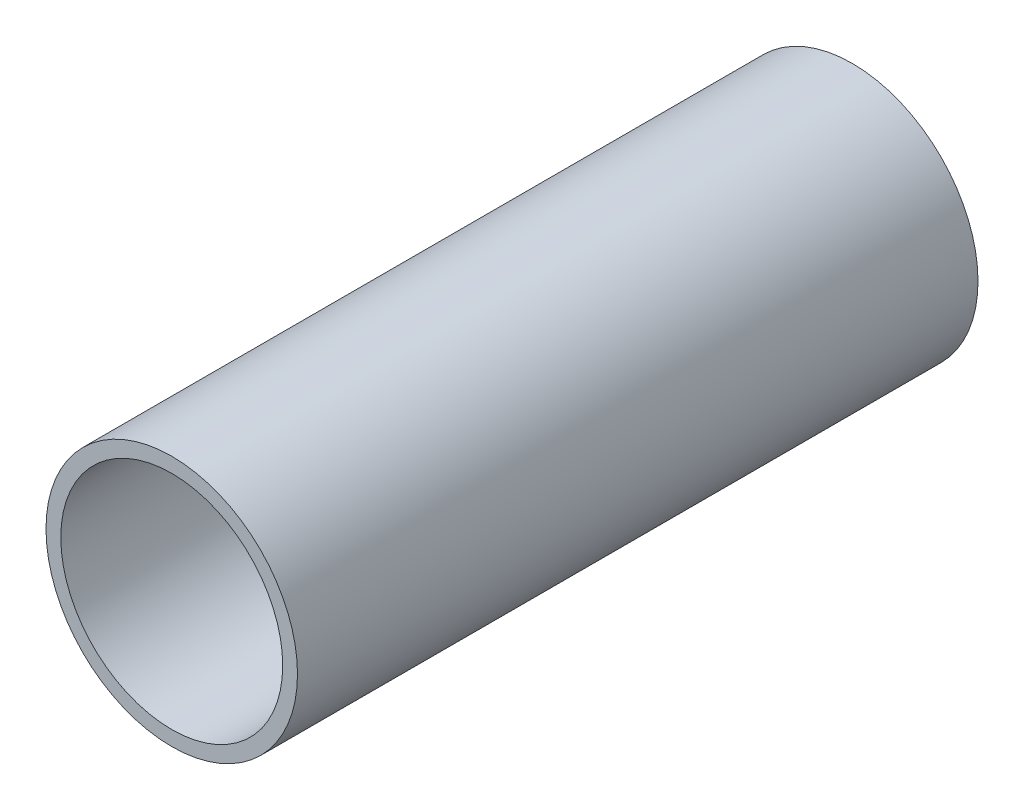
ISO-10303-21;
HEADER;
FILE_DESCRIPTION(('STEP AP214'),'2;1');
FILE_NAME('part.step','',(''),(''),'','','');
FILE_SCHEMA(('AUTOMOTIVE_DESIGN { 1 0 10303 214 1 1 1 1 }'));
ENDSEC;
DATA;
#1=APPLICATION_CONTEXT('core data for automotive mechanical design processes');
#2=APPLICATION_PROTOCOL_DEFINITION('international standard','automotive_design',2000,#1);
#3=PRODUCT_CONTEXT('',#1,'mechanical');
#4=PRODUCT('Part','Part','',(#3));
#5=PRODUCT_RELATED_PRODUCT_CATEGORY('part','',(#4));
#6=PRODUCT_DEFINITION_FORMATION('','',#4);
#7=PRODUCT_DEFINITION_CONTEXT('part definition',#1,'design');
#8=PRODUCT_DEFINITION('design','',#6,#7);
#9=PRODUCT_DEFINITION_SHAPE('','',#8);
#10=(LENGTH_UNIT() NAMED_UNIT(*) SI_UNIT(.MILLI.,.METRE.));
#11=(NAMED_UNIT(*) PLANE_ANGLE_UNIT() SI_UNIT($,.RADIAN.));
#12=(NAMED_UNIT(*) SI_UNIT($,.STERADIAN.) SOLID_ANGLE_UNIT());
#13=UNCERTAINTY_MEASURE_WITH_UNIT(LENGTH_MEASURE(1.E-05),#10,'distance_accuracy_value','');
#14=(GEOMETRIC_REPRESENTATION_CONTEXT(3) GLOBAL_UNCERTAINTY_ASSIGNED_CONTEXT((#13)) GLOBAL_UNIT_ASSIGNED_CONTEXT((#10,
#11,#12)) REPRESENTATION_CONTEXT('',''));
#15=CARTESIAN_POINT('',(0.,0.,0.));
#16=DIRECTION('',(0.,0.,1.));
#17=DIRECTION('',(1.,0.,0.));
#18=AXIS2_PLACEMENT_3D('',#15,#16,#17);
#19=CARTESIAN_POINT('',(0.,0.,460.));
#20=DIRECTION('',(0.,0.,1.));
#21=DIRECTION('',(1.,0.,0.));
#22=AXIS2_PLACEMENT_3D('',#19,#20,#21);
#23=PLANE('',#22);
#24=CARTESIAN_POINT('',(0.,0.,460.));
#25=DIRECTION('',(0.,0.,1.));
#26=DIRECTION('',(1.,0.,0.));
#27=AXIS2_PLACEMENT_3D('',#24,#25,#26);
#28=CIRCLE('',#27,85.);
#29=CARTESIAN_POINT('',(85.,0.,460.));
#30=VERTEX_POINT('',#29);
#31=EDGE_CURVE('E10',#30,#30,#28,.T.);
#32=ORIENTED_EDGE('',*,*,#31,.T.);
#33=EDGE_LOOP('',(#32));
#34=FACE_BOUND('',#33,.T.);
#35=CARTESIAN_POINT('',(0.,0.,460.));
#36=DIRECTION('',(0.,0.,1.));
#37=DIRECTION('',(1.,0.,0.));
#38=AXIS2_PLACEMENT_3D('',#35,#36,#37);
#39=CIRCLE('',#38,75.);
#40=CARTESIAN_POINT('',(75.,0.,460.));
#41=VERTEX_POINT('',#40);
#42=EDGE_CURVE('E54',#41,#41,#39,.T.);
#43=ORIENTED_EDGE('',*,*,#42,.F.);
#44=EDGE_LOOP('',(#43));
#45=FACE_BOUND('',#44,.T.);
#46=ADVANCED_FACE('F41',(#34,#45),#23,.T.);
#47=CARTESIAN_POINT('',(0.,0.,0.));
#48=DIRECTION('',(0.,0.,1.));
#49=DIRECTION('',(1.,0.,0.));
#50=AXIS2_PLACEMENT_3D('',#47,#48,#49);
#51=PLANE('',#50);
#52=CARTESIAN_POINT('',(0.,0.,0.));
#53=DIRECTION('',(0.,0.,1.));
#54=DIRECTION('',(1.,0.,0.));
#55=AXIS2_PLACEMENT_3D('',#52,#53,#54);
#56=CIRCLE('',#55,85.);
#57=CARTESIAN_POINT('',(85.,0.,0.));
#58=VERTEX_POINT('',#57);
#59=EDGE_CURVE('E45',#58,#58,#56,.T.);
#60=ORIENTED_EDGE('',*,*,#59,.F.);
#61=EDGE_LOOP('',(#60));
#62=FACE_BOUND('',#61,.T.);
#63=CARTESIAN_POINT('',(0.,0.,0.));
#64=DIRECTION('',(0.,0.,1.));
#65=DIRECTION('',(1.,0.,0.));
#66=AXIS2_PLACEMENT_3D('',#63,#64,#65);
#67=CIRCLE('',#66,75.);
#68=CARTESIAN_POINT('',(75.,0.,0.));
#69=VERTEX_POINT('',#68);
#70=EDGE_CURVE('E56',#69,#69,#67,.T.);
#71=ORIENTED_EDGE('',*,*,#70,.T.);
#72=EDGE_LOOP('',(#71));
#73=FACE_BOUND('',#72,.T.);
#74=ADVANCED_FACE('F68',(#62,#73),#51,.F.);
#75=CARTESIAN_POINT('',(0.,0.,460.));
#76=DIRECTION('',(0.,0.,-1.));
#77=DIRECTION('',(-1.,0.,0.));
#78=AXIS2_PLACEMENT_3D('',#75,#76,#77);
#79=CYLINDRICAL_SURFACE('',#78,85.);
#80=ORIENTED_EDGE('',*,*,#31,.F.);
#81=EDGE_LOOP('',(#80));
#82=FACE_BOUND('',#81,.T.);
#83=ORIENTED_EDGE('',*,*,#59,.T.);
#84=EDGE_LOOP('',(#83));
#85=FACE_BOUND('',#84,.T.);
#86=ADVANCED_FACE('F43',(#82,#85),#79,.T.);
#87=CARTESIAN_POINT('',(0.,0.,460.));
#88=DIRECTION('',(0.,0.,-1.));
#89=DIRECTION('',(-1.,0.,0.));
#90=AXIS2_PLACEMENT_3D('',#87,#88,#89);
#91=CYLINDRICAL_SURFACE('',#90,75.);
#92=ORIENTED_EDGE('',*,*,#42,.T.);
#93=EDGE_LOOP('',(#92));
#94=FACE_BOUND('',#93,.T.);
#95=ORIENTED_EDGE('',*,*,#70,.F.);
#96=EDGE_LOOP('',(#95));
#97=FACE_BOUND('',#96,.T.);
#98=ADVANCED_FACE('F64',(#94,#97),#91,.F.);
#99=CLOSED_SHELL('',(#46,#74,#86,#98));
#100=MANIFOLD_SOLID_BREP('B2',#99);
#101=ADVANCED_BREP_SHAPE_REPRESENTATION('',(#18,#100),#14);
#102=SHAPE_DEFINITION_REPRESENTATION(#9,#101);
ENDSEC;
END-ISO-10303-21;
